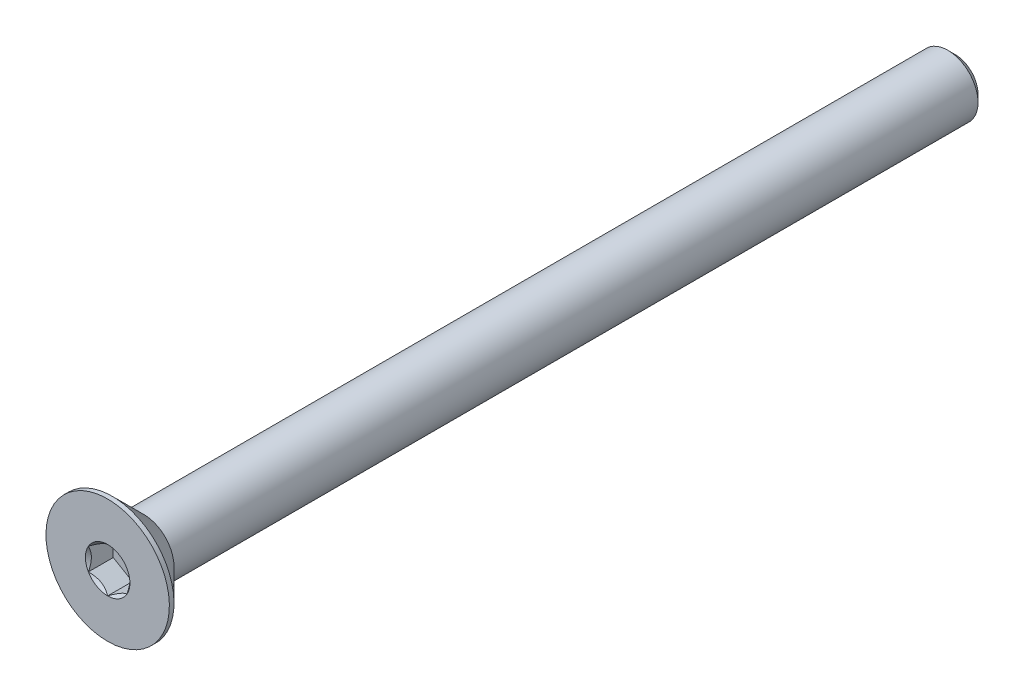
ISO-10303-21;
HEADER;
FILE_DESCRIPTION(('STEP AP214'),'2;1');
FILE_NAME('part.step','',(''),(''),'','','');
FILE_SCHEMA(('AUTOMOTIVE_DESIGN { 1 0 10303 214 1 1 1 1 }'));
ENDSEC;
DATA;
#1=APPLICATION_CONTEXT('core data for automotive mechanical design processes');
#2=APPLICATION_PROTOCOL_DEFINITION('international standard','automotive_design',2000,#1);
#3=PRODUCT_CONTEXT('',#1,'mechanical');
#4=PRODUCT('Part','Part','',(#3));
#5=PRODUCT_RELATED_PRODUCT_CATEGORY('part','',(#4));
#6=PRODUCT_DEFINITION_FORMATION('','',#4);
#7=PRODUCT_DEFINITION_CONTEXT('part definition',#1,'design');
#8=PRODUCT_DEFINITION('design','',#6,#7);
#9=PRODUCT_DEFINITION_SHAPE('','',#8);
#10=(LENGTH_UNIT() NAMED_UNIT(*) SI_UNIT(.MILLI.,.METRE.));
#11=(NAMED_UNIT(*) PLANE_ANGLE_UNIT() SI_UNIT($,.RADIAN.));
#12=(NAMED_UNIT(*) SI_UNIT($,.STERADIAN.) SOLID_ANGLE_UNIT());
#13=UNCERTAINTY_MEASURE_WITH_UNIT(LENGTH_MEASURE(1.E-05),#10,'distance_accuracy_value','');
#14=(GEOMETRIC_REPRESENTATION_CONTEXT(3) GLOBAL_UNCERTAINTY_ASSIGNED_CONTEXT((#13)) GLOBAL_UNIT_ASSIGNED_CONTEXT((#10,
#11,#12)) REPRESENTATION_CONTEXT('',''));
#15=CARTESIAN_POINT('',(0.,0.,0.));
#16=DIRECTION('',(0.,0.,1.));
#17=DIRECTION('',(1.,0.,0.));
#18=AXIS2_PLACEMENT_3D('',#15,#16,#17);
#19=CARTESIAN_POINT('',(1.25,-0.721687836487033,-1.61));
#20=DIRECTION('',(0.,0.,1.));
#21=DIRECTION('',(1.,0.,0.));
#22=AXIS2_PLACEMENT_3D('',#19,#20,#21);
#23=PLANE('',#22);
#24=DIRECTION('',(0.,1.,0.));
#25=VECTOR('',#24,1.);
#26=CARTESIAN_POINT('',(-1.25,0.721687836487033,-1.61));
#27=LINE('',#26,#25);
#28=CARTESIAN_POINT('',(-1.25,0.721687836487032,-1.61));
#29=VERTEX_POINT('',#28);
#30=CARTESIAN_POINT('',(-1.25,-0.721687836487031,-1.61));
#31=VERTEX_POINT('',#30);
#32=EDGE_CURVE('E83',#29,#31,#27,.F.);
#33=ORIENTED_EDGE('',*,*,#32,.T.);
#34=DIRECTION('',(0.866025403784439,-0.5,0.));
#35=VECTOR('',#34,1.);
#36=CARTESIAN_POINT('',(-1.25,-0.721687836487031,-1.61));
#37=LINE('',#36,#35);
#38=CARTESIAN_POINT('',(0.,-1.44337567297406,-1.61));
#39=VERTEX_POINT('',#38);
#40=EDGE_CURVE('E85',#31,#39,#37,.T.);
#41=ORIENTED_EDGE('',*,*,#40,.T.);
#42=DIRECTION('',(0.866025403784439,0.5,0.));
#43=VECTOR('',#42,1.);
#44=CARTESIAN_POINT('',(0.,-1.44337567297406,-1.61));
#45=LINE('',#44,#43);
#46=CARTESIAN_POINT('',(1.25,-0.721687836487033,-1.61));
#47=VERTEX_POINT('',#46);
#48=EDGE_CURVE('E86',#39,#47,#45,.T.);
#49=ORIENTED_EDGE('',*,*,#48,.T.);
#50=DIRECTION('',(0.,1.,0.));
#51=VECTOR('',#50,1.);
#52=CARTESIAN_POINT('',(1.25,-0.721687836487033,-1.61));
#53=LINE('',#52,#51);
#54=CARTESIAN_POINT('',(1.25,0.721687836487033,-1.61));
#55=VERTEX_POINT('',#54);
#56=EDGE_CURVE('E72',#47,#55,#53,.T.);
#57=ORIENTED_EDGE('',*,*,#56,.T.);
#58=DIRECTION('',(-0.866025403784439,0.5,0.));
#59=VECTOR('',#58,1.);
#60=CARTESIAN_POINT('',(1.25,0.721687836487033,-1.61));
#61=LINE('',#60,#59);
#62=CARTESIAN_POINT('',(0.,1.44337567297406,-1.61));
#63=VERTEX_POINT('',#62);
#64=EDGE_CURVE('E111',#55,#63,#61,.T.);
#65=ORIENTED_EDGE('',*,*,#64,.T.);
#66=DIRECTION('',(-0.866025403784439,-0.5,0.));
#67=VECTOR('',#66,1.);
#68=CARTESIAN_POINT('',(0.,1.44337567297406,-1.61));
#69=LINE('',#68,#67);
#70=EDGE_CURVE('E116',#63,#29,#69,.T.);
#71=ORIENTED_EDGE('',*,*,#70,.T.);
#72=EDGE_LOOP('',(#33,#41,#49,#57,#65,#71));
#73=FACE_BOUND('',#72,.T.);
#74=ADVANCED_FACE('F17',(#73),#23,.T.);
#75=CARTESIAN_POINT('',(0.,-1.44337567297406,-1.61));
#76=DIRECTION('',(0.5,-0.866025403784439,0.));
#77=DIRECTION('',(0.866025403784439,0.5,0.));
#78=AXIS2_PLACEMENT_3D('',#75,#76,#77);
#79=PLANE('',#78);
#80=CARTESIAN_POINT('',(-1.59633543474045E-12,-1.44337567297499,-2.26858033048088E-12));
#81=CARTESIAN_POINT('',(0.0429631084916685,-1.41857091072118,-0.0247809602853262));
#82=CARTESIAN_POINT('',(0.0866445640224962,-1.39335141061186,-0.048106250542211));
#83=CARTESIAN_POINT('',(0.175715534518587,-1.34192626181896,-0.0908138610995848));
#84=CARTESIAN_POINT('',(0.221113515509129,-1.3157157252734,-0.110172426663462));
#85=CARTESIAN_POINT('',(0.312656311401012,-1.26286346742285,-0.143333784117164));
#86=CARTESIAN_POINT('',(0.358777825771211,-1.23623519868579,-0.15721990325138));
#87=CARTESIAN_POINT('',(0.452035961001519,-1.18239258920645,-0.178614098245694));
#88=CARTESIAN_POINT('',(0.499169734949581,-1.15517989212961,-0.186138138130082));
#89=CARTESIAN_POINT('',(0.580409086338886,-1.1082763307362,-0.192927172266352));
#90=CARTESIAN_POINT('',(0.6144098218632,-1.0886459969286,-0.19393181141306));
#91=CARTESIAN_POINT('',(0.682351445146423,-1.04941988243685,-0.192236504858619));
#92=CARTESIAN_POINT('',(0.716292318027035,-1.02982411034269,-0.189535740825175));
#93=CARTESIAN_POINT('',(0.783846380048843,-0.990821754449551,-0.180585751756811));
#94=CARTESIAN_POINT('',(0.817459234875116,-0.97141536366737,-0.174333227052609));
#95=CARTESIAN_POINT('',(0.884123738991266,-0.932926594270518,-0.158616460881214));
#96=CARTESIAN_POINT('',(0.917175141068937,-0.91384435838388,-0.149150841277129));
#97=CARTESIAN_POINT('',(1.00178642984031,-0.864994008035248,-0.121071668556236));
#98=CARTESIAN_POINT('',(1.05281387539248,-0.835533298609642,-0.100350655055702));
#99=CARTESIAN_POINT('',(1.15287239429478,-0.777764485786684,-0.0536764942537954));
#100=CARTESIAN_POINT('',(1.20190935742265,-0.749452981924566,-0.0277403788128118));
#101=CARTESIAN_POINT('',(1.25000000000159,-0.721687836486111,-2.26874925040989E-12));
#102=B_SPLINE_CURVE_WITH_KNOTS('',3,(#80,#81,#82,#83,#84,#85,#86,#87,#88,#89,#90,#91,#92,#93,
#94,#95,#96,#97,#98,#99,#100,#101),.UNSPECIFIED.,.F.,.F.,(4,2,2,2,2,2,2,2,2,2,4),(0.,
0.166478683193945,0.333926926769032,0.498716658424013,0.663091654503517,0.780745575390526,
0.89842548413854,1.01621489951224,1.13405490022132,1.32111591628309,1.5075756576265),.UNSPECIFIED.);
#103=CARTESIAN_POINT('',(0.,-1.44337567297566,-1.5951974611112E-12));
#104=VERTEX_POINT('',#103);
#105=CARTESIAN_POINT('',(1.2500000000008,-0.721687836489762,-1.13440241328118E-12));
#106=VERTEX_POINT('',#105);
#107=EDGE_CURVE('E20',#104,#106,#102,.T.);
#108=ORIENTED_EDGE('',*,*,#107,.T.);
#109=DIRECTION('',(0.,0.,1.));
#110=VECTOR('',#109,1.);
#111=CARTESIAN_POINT('',(1.25,-0.721687836487033,-1.61));
#112=LINE('',#111,#110);
#113=EDGE_CURVE('E91',#106,#47,#112,.F.);
#114=ORIENTED_EDGE('',*,*,#113,.T.);
#115=ORIENTED_EDGE('',*,*,#48,.F.);
#116=DIRECTION('',(0.,0.,1.));
#117=VECTOR('',#116,1.);
#118=CARTESIAN_POINT('',(0.,-1.44337567297406,-1.61));
#119=LINE('',#118,#117);
#120=EDGE_CURVE('E59',#39,#104,#119,.T.);
#121=ORIENTED_EDGE('',*,*,#120,.T.);
#122=EDGE_LOOP('',(#108,#114,#115,#121));
#123=FACE_BOUND('',#122,.T.);
#124=ADVANCED_FACE('F90',(#123),#79,.F.);
#125=CARTESIAN_POINT('',(-1.25,-0.721687836487031,-1.61));
#126=DIRECTION('',(-0.5,-0.866025403784439,0.));
#127=DIRECTION('',(0.866025403784439,-0.5,0.));
#128=AXIS2_PLACEMENT_3D('',#125,#126,#127);
#129=PLANE('',#128);
#130=CARTESIAN_POINT('',(-1.2500000000016,-0.721687836486109,-2.26772571365198E-12));
#131=CARTESIAN_POINT('',(-1.20703689150833,-0.746492598739919,-0.0247809602853254));
#132=CARTESIAN_POINT('',(-1.1633554359775,-0.771712098849237,-0.0481062505422104));
#133=CARTESIAN_POINT('',(-1.07428446548141,-0.823137247642137,-0.0908138610995846));
#134=CARTESIAN_POINT('',(-1.02888648449087,-0.849347784187692,-0.110172426663462));
#135=CARTESIAN_POINT('',(-0.937343688598988,-0.902200042038241,-0.143333784117165));
#136=CARTESIAN_POINT('',(-0.891222174228788,-0.928828310775309,-0.15721990325138));
#137=CARTESIAN_POINT('',(-0.79796403899848,-0.98267092025465,-0.178614098245695));
#138=CARTESIAN_POINT('',(-0.750830265050418,-1.00988361733149,-0.186138138130082));
#139=CARTESIAN_POINT('',(-0.669590913661113,-1.05678717872489,-0.192927172266352));
#140=CARTESIAN_POINT('',(-0.635590178136799,-1.0764175125325,-0.193931811413061));
#141=CARTESIAN_POINT('',(-0.567648554853576,-1.11564362702425,-0.192236504858619));
#142=CARTESIAN_POINT('',(-0.533707681972964,-1.1352393991184,-0.189535740825175));
#143=CARTESIAN_POINT('',(-0.466153619951155,-1.17424175501155,-0.180585751756811));
#144=CARTESIAN_POINT('',(-0.432540765124883,-1.19364814579373,-0.174333227052609));
#145=CARTESIAN_POINT('',(-0.365876261008733,-1.23213691519058,-0.158616460881214));
#146=CARTESIAN_POINT('',(-0.332824858931062,-1.25121915107722,-0.149150841277129));
#147=CARTESIAN_POINT('',(-0.248213570159689,-1.30006950142585,-0.121071668556236));
#148=CARTESIAN_POINT('',(-0.197186124607517,-1.32953021085146,-0.100350655055702));
#149=CARTESIAN_POINT('',(-0.0971276057052169,-1.38729902367441,-0.0536764942537953));
#150=CARTESIAN_POINT('',(-0.0480906425773456,-1.41561052753653,-0.0277403788128117));
#151=CARTESIAN_POINT('',(1.59649182397064E-12,-1.44337567297499,-2.26862875383583E-12));
#152=B_SPLINE_CURVE_WITH_KNOTS('',3,(#130,#131,#132,#133,#134,#135,#136,#137,#138,#139,#140,
#141,#142,#143,#144,#145,#146,#147,#148,#149,#150,#151),.UNSPECIFIED.,.F.,.F.,(4,2,2,2,2,2,2,2,
2,2,4),(0.,0.166478683193946,0.333926926769033,0.498716658424015,0.66309165450352,
0.780745575390529,0.898425484138542,1.01621489951224,1.13405490022132,1.3211159162831,
1.5075756576265),.UNSPECIFIED.);
#153=CARTESIAN_POINT('',(-1.25000000000138,-0.721687836487828,-1.59464569232191E-12));
#154=VERTEX_POINT('',#153);
#155=EDGE_CURVE('E95',#154,#104,#152,.T.);
#156=ORIENTED_EDGE('',*,*,#155,.T.);
#157=ORIENTED_EDGE('',*,*,#120,.F.);
#158=ORIENTED_EDGE('',*,*,#40,.F.);
#159=DIRECTION('',(0.,0.,1.));
#160=VECTOR('',#159,1.);
#161=CARTESIAN_POINT('',(-1.25,-0.721687836487031,-1.61));
#162=LINE('',#161,#160);
#163=EDGE_CURVE('E97',#31,#154,#162,.T.);
#164=ORIENTED_EDGE('',*,*,#163,.T.);
#165=EDGE_LOOP('',(#156,#157,#158,#164));
#166=FACE_BOUND('',#165,.T.);
#167=ADVANCED_FACE('F93',(#166),#129,.F.);
#168=CARTESIAN_POINT('',(-1.25,0.721687836487033,-1.61));
#169=DIRECTION('',(-1.,0.,0.));
#170=DIRECTION('',(0.,0.,1.));
#171=AXIS2_PLACEMENT_3D('',#168,#169,#170);
#172=PLANE('',#171);
#173=CARTESIAN_POINT('',(-1.25,0.721687836488875,-2.26707147629576E-12));
#174=CARTESIAN_POINT('',(-1.25,0.672078311968734,-0.0247809602843515));
#175=CARTESIAN_POINT('',(-1.25,0.621639311737501,-0.0481062505397474));
#176=CARTESIAN_POINT('',(-1.25,0.518789014126518,-0.0908138610927559));
#177=CARTESIAN_POINT('',(-1.25,0.466367941022824,-0.110172426653753));
#178=CARTESIAN_POINT('',(-1.25,0.360663425297221,-0.143333784099995));
#179=CARTESIAN_POINT('',(-1.25,0.307406887811172,-0.157219903229681));
#180=CARTESIAN_POINT('',(-1.25,0.199721668829271,-0.178614098213361));
#181=CARTESIAN_POINT('',(-1.25,0.145296274664291,-0.186138138091645));
#182=CARTESIAN_POINT('',(-1.25,0.0514891518512712,-0.192927172217058));
#183=CARTESIAN_POINT('',(-1.25,0.0122284842208852,-0.19393181135857));
#184=CARTESIAN_POINT('',(-1.25,-0.0662237447923836,-0.19223650479206));
#185=CARTESIAN_POINT('',(-1.25,-0.10541528899529,-0.189535740751741));
#186=CARTESIAN_POINT('',(-1.25,-0.183420000810115,-0.180585751668415));
#187=CARTESIAN_POINT('',(-1.25,-0.222232782388411,-0.174333226956124));
#188=CARTESIAN_POINT('',(-1.25,-0.299210321209361,-0.158616460767832));
#189=CARTESIAN_POINT('',(-1.25,-0.337374792995946,-0.14915084115494));
#190=CARTESIAN_POINT('',(-1.25,-0.43507549364919,-0.121071668433227));
#191=CARTESIAN_POINT('',(-1.25,-0.493996912445358,-0.100350654949517));
#192=CARTESIAN_POINT('',(-1.25,-0.609534537985813,-0.0536764941931683));
#193=CARTESIAN_POINT('',(-1.25,-0.66615754565963,-0.0277403787809137));
#194=CARTESIAN_POINT('',(-1.25,-0.721687836488873,-2.26787846144495E-12));
#195=B_SPLINE_CURVE_WITH_KNOTS('',3,(#173,#174,#175,#176,#177,#178,#179,#180,#181,#182,#183,
#184,#185,#186,#187,#188,#189,#190,#191,#192,#193,#194),.UNSPECIFIED.,.F.,.F.,(4,2,2,2,2,2,2,2,
2,2,4),(0.,0.166478683226287,0.333926926833723,0.498716658519756,0.663091654630285,
0.780745575562284,0.89842548435534,1.01621489977414,1.13405490052833,1.3211159164188,
1.50757565759031),.UNSPECIFIED.);
#196=CARTESIAN_POINT('',(-1.25000000000138,0.72168783648783,-1.59446391689966E-12));
#197=VERTEX_POINT('',#196);
#198=EDGE_CURVE('E195',#197,#154,#195,.T.);
#199=ORIENTED_EDGE('',*,*,#198,.T.);
#200=ORIENTED_EDGE('',*,*,#163,.F.);
#201=ORIENTED_EDGE('',*,*,#32,.F.);
#202=DIRECTION('',(0.,0.,1.));
#203=VECTOR('',#202,1.);
#204=CARTESIAN_POINT('',(-1.25,0.721687836487032,-1.61));
#205=LINE('',#204,#203);
#206=EDGE_CURVE('E113',#29,#197,#205,.T.);
#207=ORIENTED_EDGE('',*,*,#206,.T.);
#208=EDGE_LOOP('',(#199,#200,#201,#207));
#209=FACE_BOUND('',#208,.T.);
#210=ADVANCED_FACE('F205',(#209),#172,.F.);
#211=CARTESIAN_POINT('',(0.,1.44337567297406,-1.61));
#212=DIRECTION('',(-0.5,0.866025403784439,0.));
#213=DIRECTION('',(-0.866025403784439,-0.5,0.));
#214=AXIS2_PLACEMENT_3D('',#211,#212,#213);
#215=PLANE('',#214);
#216=CARTESIAN_POINT('',(1.59613279499456E-12,1.44337567297499,-2.26834000168424E-12));
#217=CARTESIAN_POINT('',(-0.0429631084916687,1.41857091072118,-0.024780960285326));
#218=CARTESIAN_POINT('',(-0.0866445640224964,1.39335141061186,-0.0481062505422108));
#219=CARTESIAN_POINT('',(-0.175715534518587,1.34192626181896,-0.0908138610995847));
#220=CARTESIAN_POINT('',(-0.22111351550913,1.3157157252734,-0.110172426663462));
#221=CARTESIAN_POINT('',(-0.312656311401012,1.26286346742285,-0.143333784117164));
#222=CARTESIAN_POINT('',(-0.358777825771212,1.23623519868579,-0.15721990325138));
#223=CARTESIAN_POINT('',(-0.45203596100152,1.18239258920645,-0.178614098245694));
#224=CARTESIAN_POINT('',(-0.499169734949581,1.15517989212961,-0.186138138130082));
#225=CARTESIAN_POINT('',(-0.580409086338886,1.1082763307362,-0.192927172266352));
#226=CARTESIAN_POINT('',(-0.6144098218632,1.0886459969286,-0.19393181141306));
#227=CARTESIAN_POINT('',(-0.682351445146423,1.04941988243685,-0.192236504858619));
#228=CARTESIAN_POINT('',(-0.716292318027036,1.02982411034269,-0.189535740825175));
#229=CARTESIAN_POINT('',(-0.783846380048844,0.99082175444955,-0.180585751756811));
#230=CARTESIAN_POINT('',(-0.817459234875117,0.97141536366737,-0.174333227052609));
#231=CARTESIAN_POINT('',(-0.884123738991267,0.932926594270518,-0.158616460881213));
#232=CARTESIAN_POINT('',(-0.917175141068938,0.91384435838388,-0.149150841277128));
#233=CARTESIAN_POINT('',(-1.00178642984031,0.864994008035247,-0.121071668556235));
#234=CARTESIAN_POINT('',(-1.05281387539248,0.835533298609641,-0.100350655055701));
#235=CARTESIAN_POINT('',(-1.15287239429478,0.777764485786683,-0.0536764942537944));
#236=CARTESIAN_POINT('',(-1.20190935742265,0.749452981924565,-0.0277403788128108));
#237=CARTESIAN_POINT('',(-1.2500000000016,0.721687836486111,-2.26788103424833E-12));
#238=B_SPLINE_CURVE_WITH_KNOTS('',3,(#216,#217,#218,#219,#220,#221,#222,#223,#224,#225,#226,
#227,#228,#229,#230,#231,#232,#233,#234,#235,#236,#237),.UNSPECIFIED.,.F.,.F.,(4,2,2,2,2,2,2,2,
2,2,4),(0.,0.166478683193945,0.333926926769032,0.498716658424013,0.663091654503518,
0.780745575390527,0.898425484138541,1.01621489951224,1.13405490022132,1.3211159162831,
1.5075756576265),.UNSPECIFIED.);
#239=CARTESIAN_POINT('',(0.,1.44337567297566,-1.59483068508603E-12));
#240=VERTEX_POINT('',#239);
#241=EDGE_CURVE('E187',#240,#197,#238,.T.);
#242=ORIENTED_EDGE('',*,*,#241,.T.);
#243=ORIENTED_EDGE('',*,*,#206,.F.);
#244=ORIENTED_EDGE('',*,*,#70,.F.);
#245=DIRECTION('',(0.,0.,1.));
#246=VECTOR('',#245,1.);
#247=CARTESIAN_POINT('',(0.,1.44337567297406,-1.61));
#248=LINE('',#247,#246);
#249=EDGE_CURVE('E108',#63,#240,#248,.T.);
#250=ORIENTED_EDGE('',*,*,#249,.T.);
#251=EDGE_LOOP('',(#242,#243,#244,#250));
#252=FACE_BOUND('',#251,.T.);
#253=ADVANCED_FACE('F201',(#252),#215,.F.);
#254=CARTESIAN_POINT('',(1.25,0.721687836487033,-1.61));
#255=DIRECTION('',(0.5,0.866025403784439,0.));
#256=DIRECTION('',(-0.866025403784439,0.5,0.));
#257=AXIS2_PLACEMENT_3D('',#254,#255,#256);
#258=PLANE('',#257);
#259=CARTESIAN_POINT('',(1.2500000000016,0.721687836486112,-2.26853653144477E-12));
#260=CARTESIAN_POINT('',(1.20703689150833,0.746492598739921,-0.0247809602853261));
#261=CARTESIAN_POINT('',(1.1633554359775,0.771712098849239,-0.0481062505422108));
#262=CARTESIAN_POINT('',(1.07428446548141,0.823137247642138,-0.0908138610995846));
#263=CARTESIAN_POINT('',(1.02888648449087,0.849347784187693,-0.110172426663462));
#264=CARTESIAN_POINT('',(0.937343688598987,0.902200042038243,-0.143333784117164));
#265=CARTESIAN_POINT('',(0.891222174228788,0.92882831077531,-0.15721990325138));
#266=CARTESIAN_POINT('',(0.79796403899848,0.982670920254651,-0.178614098245694));
#267=CARTESIAN_POINT('',(0.750830265050419,1.00988361733149,-0.186138138130081));
#268=CARTESIAN_POINT('',(0.669590913661114,1.05678717872489,-0.192927172266351));
#269=CARTESIAN_POINT('',(0.6355901781368,1.0764175125325,-0.19393181141306));
#270=CARTESIAN_POINT('',(0.567648554853577,1.11564362702425,-0.192236504858619));
#271=CARTESIAN_POINT('',(0.533707681972964,1.1352393991184,-0.189535740825174));
#272=CARTESIAN_POINT('',(0.466153619951156,1.17424175501155,-0.180585751756811));
#273=CARTESIAN_POINT('',(0.432540765124883,1.19364814579373,-0.174333227052609));
#274=CARTESIAN_POINT('',(0.365876261008733,1.23213691519058,-0.158616460881213));
#275=CARTESIAN_POINT('',(0.332824858931062,1.25121915107722,-0.149150841277128));
#276=CARTESIAN_POINT('',(0.24821357015969,1.30006950142585,-0.121071668556235));
#277=CARTESIAN_POINT('',(0.197186124607517,1.32953021085146,-0.100350655055702));
#278=CARTESIAN_POINT('',(0.0971276057052174,1.38729902367441,-0.0536764942537946));
#279=CARTESIAN_POINT('',(0.0480906425773461,1.41561052753653,-0.0277403788128111));
#280=CARTESIAN_POINT('',(-1.59614565415006E-12,1.44337567297499,-2.26815881940463E-12));
#281=B_SPLINE_CURVE_WITH_KNOTS('',3,(#259,#260,#261,#262,#263,#264,#265,#266,#267,#268,#269,
#270,#271,#272,#273,#274,#275,#276,#277,#278,#279,#280),.UNSPECIFIED.,.F.,.F.,(4,2,2,2,2,2,2,2,
2,2,4),(0.,0.166478683193945,0.333926926769031,0.498716658424013,0.663091654503516,
0.780745575390525,0.898425484138539,1.01621489951224,1.13405490022132,1.32111591628309,
1.5075756576265),.UNSPECIFIED.);
#282=CARTESIAN_POINT('',(1.25000000000138,0.721687836487831,-1.59505075853978E-12));
#283=VERTEX_POINT('',#282);
#284=EDGE_CURVE('E157',#283,#240,#281,.T.);
#285=ORIENTED_EDGE('',*,*,#284,.T.);
#286=ORIENTED_EDGE('',*,*,#249,.F.);
#287=ORIENTED_EDGE('',*,*,#64,.F.);
#288=DIRECTION('',(0.,0.,1.));
#289=VECTOR('',#288,1.);
#290=CARTESIAN_POINT('',(1.25,0.721687836487033,-1.61));
#291=LINE('',#290,#289);
#292=EDGE_CURVE('E40',#55,#283,#291,.T.);
#293=ORIENTED_EDGE('',*,*,#292,.T.);
#294=EDGE_LOOP('',(#285,#286,#287,#293));
#295=FACE_BOUND('',#294,.T.);
#296=ADVANCED_FACE('F204',(#295),#258,.F.);
#297=CARTESIAN_POINT('',(1.25,-0.721687836487033,-1.61));
#298=DIRECTION('',(1.,0.,0.));
#299=DIRECTION('',(0.,1.,0.));
#300=AXIS2_PLACEMENT_3D('',#297,#298,#299);
#301=PLANE('',#300);
#302=CARTESIAN_POINT('',(1.25,-0.721687836488877,-2.26868120904467E-12));
#303=CARTESIAN_POINT('',(1.25,-0.672078311968736,-0.0247809602843532));
#304=CARTESIAN_POINT('',(1.25,-0.621639311737502,-0.0481062505397492));
#305=CARTESIAN_POINT('',(1.25,-0.51878901412652,-0.0908138610927579));
#306=CARTESIAN_POINT('',(1.25,-0.466367941022825,-0.110172426653756));
#307=CARTESIAN_POINT('',(1.25,-0.360663425297223,-0.143333784099998));
#308=CARTESIAN_POINT('',(1.25,-0.307406887811173,-0.157219903229684));
#309=CARTESIAN_POINT('',(1.25,-0.199721668829271,-0.178614098213363));
#310=CARTESIAN_POINT('',(1.25,-0.145296274664292,-0.186138138091648));
#311=CARTESIAN_POINT('',(1.25,-0.0514891518512717,-0.19292717221706));
#312=CARTESIAN_POINT('',(1.25,-0.0122284842208858,-0.193931811358573));
#313=CARTESIAN_POINT('',(1.25,0.0662237447923829,-0.192236504792063));
#314=CARTESIAN_POINT('',(1.25,0.105415288995289,-0.189535740751744));
#315=CARTESIAN_POINT('',(1.25,0.183420000810114,-0.180585751668418));
#316=CARTESIAN_POINT('',(1.25,0.22223278238841,-0.174333226956126));
#317=CARTESIAN_POINT('',(1.25,0.299210321209359,-0.158616460767835));
#318=CARTESIAN_POINT('',(1.25,0.337374792995945,-0.149150841154943));
#319=CARTESIAN_POINT('',(1.25,0.43507549364919,-0.121071668433229));
#320=CARTESIAN_POINT('',(1.25,0.493996912445358,-0.100350654949519));
#321=CARTESIAN_POINT('',(1.25,0.609534537985814,-0.0536764941931697));
#322=CARTESIAN_POINT('',(1.25,0.666157545659632,-0.0277403787809148));
#323=CARTESIAN_POINT('',(1.25,0.721687836488876,-2.26852812832509E-12));
#324=B_SPLINE_CURVE_WITH_KNOTS('',3,(#302,#303,#304,#305,#306,#307,#308,#309,#310,#311,#312,
#313,#314,#315,#316,#317,#318,#319,#320,#321,#322,#323),.UNSPECIFIED.,.F.,.F.,(4,2,2,2,2,2,2,2,
2,2,4),(0.,0.166478683226287,0.333926926833724,0.498716658519757,0.663091654630287,
0.780745575562285,0.898425484355342,1.01621489977414,1.13405490052833,1.3211159164188,
1.50757565759032),.UNSPECIFIED.);
#325=EDGE_CURVE('E149',#106,#283,#324,.T.);
#326=ORIENTED_EDGE('',*,*,#325,.T.);
#327=ORIENTED_EDGE('',*,*,#292,.F.);
#328=ORIENTED_EDGE('',*,*,#56,.F.);
#329=ORIENTED_EDGE('',*,*,#113,.F.);
#330=EDGE_LOOP('',(#326,#327,#328,#329));
#331=FACE_BOUND('',#330,.T.);
#332=ADVANCED_FACE('F165',(#331),#301,.F.);
#333=CARTESIAN_POINT('',(0.,0.,-5.6843418860808E-11));
#334=DIRECTION('',(0.,0.,1.));
#335=DIRECTION('',(1.,0.,0.));
#336=AXIS2_PLACEMENT_3D('',#333,#334,#335);
#337=CONICAL_SURFACE('',#336,1.44337567292041,0.78539816325135);
#338=ORIENTED_EDGE('',*,*,#107,.F.);
#339=CARTESIAN_POINT('',(0.,0.,0.));
#340=DIRECTION('',(0.,0.,1.));
#341=DIRECTION('',(1.,0.,0.));
#342=AXIS2_PLACEMENT_3D('',#339,#340,#341);
#343=CIRCLE('',#342,1.44337567297725);
#344=EDGE_CURVE('E146',#106,#104,#343,.F.);
#345=ORIENTED_EDGE('',*,*,#344,.F.);
#346=EDGE_LOOP('',(#338,#345));
#347=FACE_BOUND('',#346,.T.);
#348=ADVANCED_FACE('F222',(#347),#337,.F.);
#349=CARTESIAN_POINT('',(0.,0.,-5.6843418860808E-11));
#350=DIRECTION('',(0.,0.,1.));
#351=DIRECTION('',(1.,0.,0.));
#352=AXIS2_PLACEMENT_3D('',#349,#350,#351);
#353=CONICAL_SURFACE('',#352,1.44337567292041,0.78539816325135);
#354=ORIENTED_EDGE('',*,*,#155,.F.);
#355=CARTESIAN_POINT('',(0.,0.,0.));
#356=DIRECTION('',(0.,0.,1.));
#357=DIRECTION('',(1.,0.,0.));
#358=AXIS2_PLACEMENT_3D('',#355,#356,#357);
#359=CIRCLE('',#358,1.44337567297725);
#360=EDGE_CURVE('E143',#104,#154,#359,.F.);
#361=ORIENTED_EDGE('',*,*,#360,.F.);
#362=EDGE_LOOP('',(#354,#361));
#363=FACE_BOUND('',#362,.T.);
#364=ADVANCED_FACE('F219',(#363),#353,.F.);
#365=CARTESIAN_POINT('',(0.,0.,-5.6843418860808E-11));
#366=DIRECTION('',(0.,0.,1.));
#367=DIRECTION('',(1.,0.,0.));
#368=AXIS2_PLACEMENT_3D('',#365,#366,#367);
#369=CONICAL_SURFACE('',#368,1.44337567292041,0.785398163397448);
#370=ORIENTED_EDGE('',*,*,#198,.F.);
#371=CARTESIAN_POINT('',(0.,0.,0.));
#372=DIRECTION('',(0.,0.,1.));
#373=DIRECTION('',(1.,0.,0.));
#374=AXIS2_PLACEMENT_3D('',#371,#372,#373);
#375=CIRCLE('',#374,1.44337567297725);
#376=EDGE_CURVE('E140',#154,#197,#375,.F.);
#377=ORIENTED_EDGE('',*,*,#376,.F.);
#378=EDGE_LOOP('',(#370,#377));
#379=FACE_BOUND('',#378,.T.);
#380=ADVANCED_FACE('F183',(#379),#369,.F.);
#381=CARTESIAN_POINT('',(0.,0.,-5.6843418860808E-11));
#382=DIRECTION('',(0.,0.,1.));
#383=DIRECTION('',(1.,0.,0.));
#384=AXIS2_PLACEMENT_3D('',#381,#382,#383);
#385=CONICAL_SURFACE('',#384,1.44337567292041,0.78539816325135);
#386=ORIENTED_EDGE('',*,*,#241,.F.);
#387=CARTESIAN_POINT('',(0.,0.,0.));
#388=DIRECTION('',(0.,0.,1.));
#389=DIRECTION('',(1.,0.,0.));
#390=AXIS2_PLACEMENT_3D('',#387,#388,#389);
#391=CIRCLE('',#390,1.44337567297725);
#392=EDGE_CURVE('E137',#197,#240,#391,.F.);
#393=ORIENTED_EDGE('',*,*,#392,.F.);
#394=EDGE_LOOP('',(#386,#393));
#395=FACE_BOUND('',#394,.T.);
#396=ADVANCED_FACE('F178',(#395),#385,.F.);
#397=CARTESIAN_POINT('',(0.,0.,-5.6843418860808E-11));
#398=DIRECTION('',(0.,0.,1.));
#399=DIRECTION('',(1.,0.,0.));
#400=AXIS2_PLACEMENT_3D('',#397,#398,#399);
#401=CONICAL_SURFACE('',#400,1.44337567292041,0.78539816325135);
#402=ORIENTED_EDGE('',*,*,#284,.F.);
#403=CARTESIAN_POINT('',(0.,0.,0.));
#404=DIRECTION('',(0.,0.,1.));
#405=DIRECTION('',(1.,0.,0.));
#406=AXIS2_PLACEMENT_3D('',#403,#404,#405);
#407=CIRCLE('',#406,1.44337567297725);
#408=EDGE_CURVE('E134',#240,#283,#407,.F.);
#409=ORIENTED_EDGE('',*,*,#408,.F.);
#410=EDGE_LOOP('',(#402,#409));
#411=FACE_BOUND('',#410,.T.);
#412=ADVANCED_FACE('F172',(#411),#401,.F.);
#413=CARTESIAN_POINT('',(0.,0.,-5.6843418860808E-11));
#414=DIRECTION('',(0.,0.,1.));
#415=DIRECTION('',(1.,0.,0.));
#416=AXIS2_PLACEMENT_3D('',#413,#414,#415);
#417=CONICAL_SURFACE('',#416,1.44337567292041,0.785398163397448);
#418=CARTESIAN_POINT('',(0.,0.,0.));
#419=DIRECTION('',(0.,0.,1.));
#420=DIRECTION('',(1.,0.,0.));
#421=AXIS2_PLACEMENT_3D('',#418,#419,#420);
#422=CIRCLE('',#421,1.44337567297725);
#423=EDGE_CURVE('E131',#283,#106,#422,.F.);
#424=ORIENTED_EDGE('',*,*,#423,.F.);
#425=ORIENTED_EDGE('',*,*,#325,.F.);
#426=EDGE_LOOP('',(#424,#425));
#427=FACE_BOUND('',#426,.T.);
#428=ADVANCED_FACE('F167',(#427),#417,.F.);
#429=CARTESIAN_POINT('',(0.,-2.,0.));
#430=DIRECTION('',(0.,0.,1.));
#431=DIRECTION('',(0.,-1.,0.));
#432=AXIS2_PLACEMENT_3D('',#429,#430,#431);
#433=PLANE('',#432);
#434=ORIENTED_EDGE('',*,*,#408,.T.);
#435=ORIENTED_EDGE('',*,*,#423,.T.);
#436=ORIENTED_EDGE('',*,*,#344,.T.);
#437=ORIENTED_EDGE('',*,*,#360,.T.);
#438=ORIENTED_EDGE('',*,*,#376,.T.);
#439=ORIENTED_EDGE('',*,*,#392,.T.);
#440=EDGE_LOOP('',(#434,#435,#436,#437,#438,#439));
#441=FACE_BOUND('',#440,.T.);
#442=CARTESIAN_POINT('',(0.,0.,0.));
#443=DIRECTION('',(0.,0.,1.));
#444=DIRECTION('',(0.,-1.,0.));
#445=AXIS2_PLACEMENT_3D('',#442,#443,#444);
#446=CIRCLE('',#445,4.);
#447=CARTESIAN_POINT('',(0.,-4.,0.));
#448=VERTEX_POINT('',#447);
#449=EDGE_CURVE('E128',#448,#448,#446,.F.);
#450=ORIENTED_EDGE('',*,*,#449,.F.);
#451=EDGE_LOOP('',(#450));
#452=FACE_BOUND('',#451,.T.);
#453=ADVANCED_FACE('F171',(#441,#452),#433,.T.);
#454=CARTESIAN_POINT('',(0.,-2.,-54.9499999999999));
#455=DIRECTION('',(0.,0.,-1.));
#456=DIRECTION('',(0.,1.,0.));
#457=AXIS2_PLACEMENT_3D('',#454,#455,#456);
#458=PLANE('',#457);
#459=CARTESIAN_POINT('',(0.,0.,-54.9499999999625));
#460=DIRECTION('',(0.,0.,1.));
#461=DIRECTION('',(1.,0.,0.));
#462=AXIS2_PLACEMENT_3D('',#459,#460,#461);
#463=CIRCLE('',#462,1.47500000002765);
#464=CARTESIAN_POINT('',(1.47500000002765,0.,-54.9499999999625));
#465=VERTEX_POINT('',#464);
#466=EDGE_CURVE('E124',#465,#465,#463,.T.);
#467=ORIENTED_EDGE('',*,*,#466,.F.);
#468=EDGE_LOOP('',(#467));
#469=FACE_BOUND('',#468,.T.);
#470=ADVANCED_FACE('F250',(#469),#458,.T.);
#471=CARTESIAN_POINT('',(0.,0.,0.));
#472=DIRECTION('',(0.,0.,1.));
#473=DIRECTION('',(0.,-1.,0.));
#474=AXIS2_PLACEMENT_3D('',#471,#472,#473);
#475=CYLINDRICAL_SURFACE('',#474,4.);
#476=CARTESIAN_POINT('',(0.,0.,-0.299999999981541));
#477=DIRECTION('',(0.,0.,1.));
#478=DIRECTION('',(0.,-1.,0.));
#479=AXIS2_PLACEMENT_3D('',#476,#477,#478);
#480=CIRCLE('',#479,4.0000000000191);
#481=CARTESIAN_POINT('',(0.,-4.0000000000191,-0.299999999981537));
#482=VERTEX_POINT('',#481);
#483=EDGE_CURVE('E127',#482,#482,#480,.F.);
#484=ORIENTED_EDGE('',*,*,#483,.F.);
#485=EDGE_LOOP('',(#484));
#486=FACE_BOUND('',#485,.T.);
#487=ORIENTED_EDGE('',*,*,#449,.T.);
#488=EDGE_LOOP('',(#487));
#489=FACE_BOUND('',#488,.T.);
#490=ADVANCED_FACE('F247',(#486,#489),#475,.T.);
#491=CARTESIAN_POINT('',(0.,0.,-54.4709999999782));
#492=DIRECTION('',(0.,0.,1.));
#493=DIRECTION('',(1.,0.,0.));
#494=AXIS2_PLACEMENT_3D('',#491,#492,#493);
#495=CONICAL_SURFACE('',#494,1.954000000012,0.785398163397448);
#496=CARTESIAN_POINT('',(0.,0.,-54.471));
#497=DIRECTION('',(0.,0.,-1.));
#498=DIRECTION('',(0.,1.,0.));
#499=AXIS2_PLACEMENT_3D('',#496,#497,#498);
#500=CIRCLE('',#499,1.954);
#501=CARTESIAN_POINT('',(0.,1.954,-54.471));
#502=VERTEX_POINT('',#501);
#503=EDGE_CURVE('E31',#502,#502,#500,.F.);
#504=ORIENTED_EDGE('',*,*,#503,.F.);
#505=EDGE_LOOP('',(#504));
#506=FACE_BOUND('',#505,.T.);
#507=ORIENTED_EDGE('',*,*,#466,.T.);
#508=EDGE_LOOP('',(#507));
#509=FACE_BOUND('',#508,.T.);
#510=ADVANCED_FACE('F240',(#506,#509),#495,.T.);
#511=CARTESIAN_POINT('',(0.,0.,-0.299999999924697));
#512=DIRECTION('',(0.,0.,1.));
#513=DIRECTION('',(0.,-1.,0.));
#514=AXIS2_PLACEMENT_3D('',#511,#512,#513);
#515=CONICAL_SURFACE('',#514,4.00000000007594,0.785398163397449);
#516=CARTESIAN_POINT('',(0.,0.,-2.34599999999999));
#517=DIRECTION('',(0.,0.,-1.));
#518=DIRECTION('',(0.,1.,0.));
#519=AXIS2_PLACEMENT_3D('',#516,#517,#518);
#520=CIRCLE('',#519,1.954);
#521=CARTESIAN_POINT('',(0.,1.954,-2.34599999999999));
#522=VERTEX_POINT('',#521);
#523=EDGE_CURVE('E11',#522,#522,#520,.T.);
#524=ORIENTED_EDGE('',*,*,#523,.F.);
#525=EDGE_LOOP('',(#524));
#526=FACE_BOUND('',#525,.T.);
#527=ORIENTED_EDGE('',*,*,#483,.T.);
#528=EDGE_LOOP('',(#527));
#529=FACE_BOUND('',#528,.T.);
#530=ADVANCED_FACE('F234',(#526,#529),#515,.T.);
#531=CARTESIAN_POINT('',(0.,0.,-54.9499999999999));
#532=DIRECTION('',(0.,0.,-1.));
#533=DIRECTION('',(0.,1.,0.));
#534=AXIS2_PLACEMENT_3D('',#531,#532,#533);
#535=CYLINDRICAL_SURFACE('',#534,1.954);
#536=ORIENTED_EDGE('',*,*,#523,.T.);
#537=EDGE_LOOP('',(#536));
#538=FACE_BOUND('',#537,.T.);
#539=ORIENTED_EDGE('',*,*,#503,.T.);
#540=EDGE_LOOP('',(#539));
#541=FACE_BOUND('',#540,.T.);
#542=ADVANCED_FACE('F232',(#538,#541),#535,.T.);
#543=CLOSED_SHELL('',(#74,#124,#167,#210,#253,#296,#332,#348,#364,#380,#396,#412,#428,#453,#470,
#490,#510,#530,#542));
#544=MANIFOLD_SOLID_BREP('B1',#543);
#545=ADVANCED_BREP_SHAPE_REPRESENTATION('',(#18,#544),#14);
#546=SHAPE_DEFINITION_REPRESENTATION(#9,#545);
ENDSEC;
END-ISO-10303-21;
